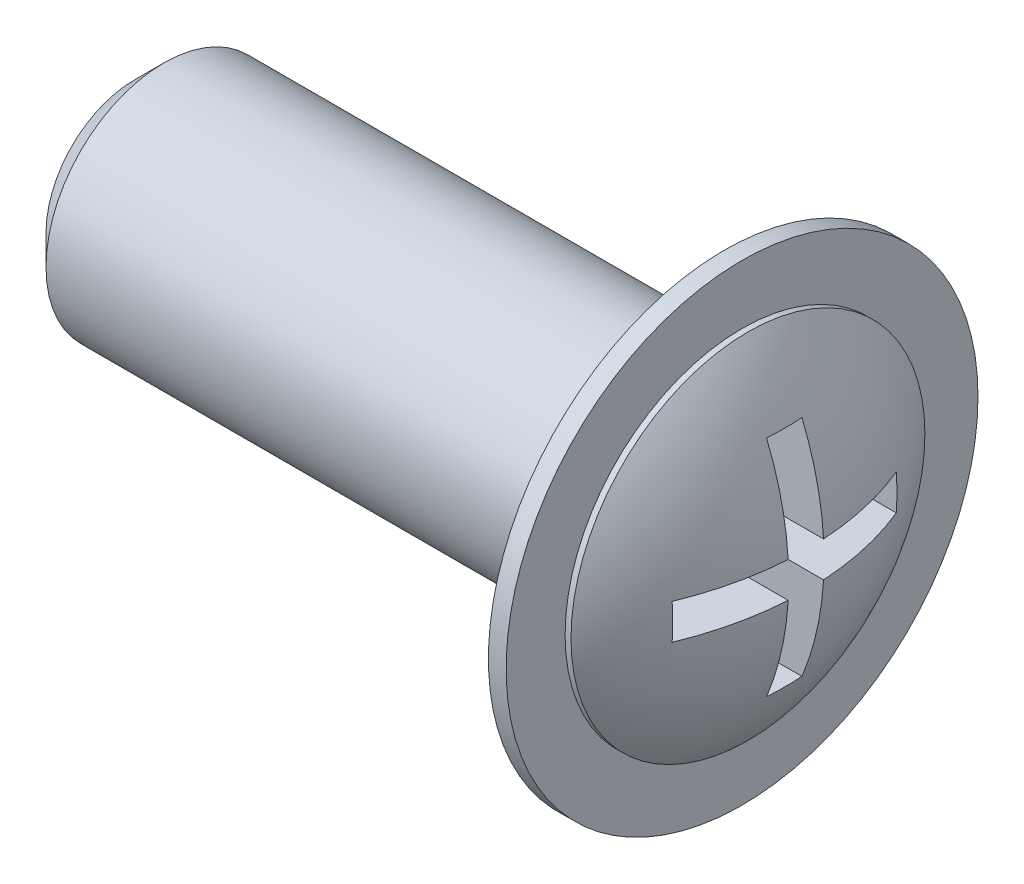
ISO-10303-21;
HEADER;
FILE_DESCRIPTION(('STEP AP214'),'2;1');
FILE_NAME('part.step','',(''),(''),'','','');
FILE_SCHEMA(('AUTOMOTIVE_DESIGN { 1 0 10303 214 1 1 1 1 }'));
ENDSEC;
DATA;
#1=APPLICATION_CONTEXT('core data for automotive mechanical design processes');
#2=APPLICATION_PROTOCOL_DEFINITION('international standard','automotive_design',2000,#1);
#3=PRODUCT_CONTEXT('',#1,'mechanical');
#4=PRODUCT('Part','Part','',(#3));
#5=PRODUCT_RELATED_PRODUCT_CATEGORY('part','',(#4));
#6=PRODUCT_DEFINITION_FORMATION('','',#4);
#7=PRODUCT_DEFINITION_CONTEXT('part definition',#1,'design');
#8=PRODUCT_DEFINITION('design','',#6,#7);
#9=PRODUCT_DEFINITION_SHAPE('','',#8);
#10=(LENGTH_UNIT() NAMED_UNIT(*) SI_UNIT(.MILLI.,.METRE.));
#11=(NAMED_UNIT(*) PLANE_ANGLE_UNIT() SI_UNIT($,.RADIAN.));
#12=(NAMED_UNIT(*) SI_UNIT($,.STERADIAN.) SOLID_ANGLE_UNIT());
#13=UNCERTAINTY_MEASURE_WITH_UNIT(LENGTH_MEASURE(1.E-05),#10,'distance_accuracy_value','');
#14=(GEOMETRIC_REPRESENTATION_CONTEXT(3) GLOBAL_UNCERTAINTY_ASSIGNED_CONTEXT((#13)) GLOBAL_UNIT_ASSIGNED_CONTEXT((#10,
#11,#12)) REPRESENTATION_CONTEXT('',''));
#15=CARTESIAN_POINT('',(0.,0.,0.));
#16=DIRECTION('',(0.,0.,1.));
#17=DIRECTION('',(1.,0.,0.));
#18=AXIS2_PLACEMENT_3D('',#15,#16,#17);
#19=CARTESIAN_POINT('',(-3.6,0.,0.));
#20=DIRECTION('',(0.,0.,1.));
#21=DIRECTION('',(1.,0.,0.));
#22=AXIS2_PLACEMENT_3D('',#19,#20,#21);
#23=SPHERICAL_SURFACE('',#22,5.);
#24=CARTESIAN_POINT('',(0.4,0.,0.));
#25=DIRECTION('',(1.,0.,0.));
#26=DIRECTION('',(0.,0.,-1.));
#27=AXIS2_PLACEMENT_3D('',#24,#25,#26);
#28=CIRCLE('',#27,3.);
#29=CARTESIAN_POINT('',(0.4,0.,-3.));
#30=VERTEX_POINT('',#29);
#31=EDGE_CURVE('E197',#30,#30,#28,.T.);
#32=ORIENTED_EDGE('',*,*,#31,.T.);
#33=EDGE_LOOP('',(#32));
#34=FACE_BOUND('',#33,.T.);
#35=CARTESIAN_POINT('',(-3.6,1.9,0.));
#36=DIRECTION('',(0.,-1.,0.));
#37=DIRECTION('',(0.,0.,-1.));
#38=AXIS2_PLACEMENT_3D('',#35,#36,#37);
#39=CIRCLE('',#38,4.62493243193887);
#40=CARTESIAN_POINT('',(1.01519230368573,1.9,0.3));
#41=VERTEX_POINT('',#40);
#42=CARTESIAN_POINT('',(1.01519230368573,1.9,-0.3));
#43=VERTEX_POINT('',#42);
#44=EDGE_CURVE('E239',#41,#43,#39,.F.);
#45=ORIENTED_EDGE('',*,*,#44,.T.);
#46=CARTESIAN_POINT('',(-3.6,0.,-0.3));
#47=DIRECTION('',(0.,0.,1.));
#48=DIRECTION('',(0.,-1.,0.));
#49=AXIS2_PLACEMENT_3D('',#46,#47,#48);
#50=CIRCLE('',#49,4.99099188538711);
#51=CARTESIAN_POINT('',(1.38196748283246,0.3,-0.3));
#52=VERTEX_POINT('',#51);
#53=EDGE_CURVE('E60',#43,#52,#50,.F.);
#54=ORIENTED_EDGE('',*,*,#53,.T.);
#55=CARTESIAN_POINT('',(-3.6,0.3,0.));
#56=DIRECTION('',(0.,-1.,0.));
#57=DIRECTION('',(0.,0.,-1.));
#58=AXIS2_PLACEMENT_3D('',#55,#56,#57);
#59=CIRCLE('',#58,4.99099188538711);
#60=CARTESIAN_POINT('',(1.01519230368573,0.3,-1.9));
#61=VERTEX_POINT('',#60);
#62=EDGE_CURVE('E207',#52,#61,#59,.F.);
#63=ORIENTED_EDGE('',*,*,#62,.T.);
#64=CARTESIAN_POINT('',(-3.6,0.,-1.9));
#65=DIRECTION('',(0.,0.,1.));
#66=DIRECTION('',(1.,0.,0.));
#67=AXIS2_PLACEMENT_3D('',#64,#65,#66);
#68=CIRCLE('',#67,4.62493243193887);
#69=CARTESIAN_POINT('',(1.01519230368573,-0.3,-1.9));
#70=VERTEX_POINT('',#69);
#71=EDGE_CURVE('E212',#61,#70,#68,.F.);
#72=ORIENTED_EDGE('',*,*,#71,.T.);
#73=CARTESIAN_POINT('',(-3.6,-0.3,0.));
#74=DIRECTION('',(0.,1.,0.));
#75=DIRECTION('',(0.,0.,1.));
#76=AXIS2_PLACEMENT_3D('',#73,#74,#75);
#77=CIRCLE('',#76,4.99099188538711);
#78=CARTESIAN_POINT('',(1.38196748283246,-0.3,-0.3));
#79=VERTEX_POINT('',#78);
#80=EDGE_CURVE('E215',#70,#79,#77,.F.);
#81=ORIENTED_EDGE('',*,*,#80,.T.);
#82=CARTESIAN_POINT('',(-3.6,0.,-0.3));
#83=DIRECTION('',(0.,0.,1.));
#84=DIRECTION('',(0.,-1.,0.));
#85=AXIS2_PLACEMENT_3D('',#82,#83,#84);
#86=CIRCLE('',#85,4.99099188538711);
#87=CARTESIAN_POINT('',(1.01519230368573,-1.9,-0.3));
#88=VERTEX_POINT('',#87);
#89=EDGE_CURVE('E218',#79,#88,#86,.F.);
#90=ORIENTED_EDGE('',*,*,#89,.T.);
#91=CARTESIAN_POINT('',(-3.6,-1.9,0.));
#92=DIRECTION('',(0.,1.,0.));
#93=DIRECTION('',(0.,0.,1.));
#94=AXIS2_PLACEMENT_3D('',#91,#92,#93);
#95=CIRCLE('',#94,4.62493243193887);
#96=CARTESIAN_POINT('',(1.01519230368573,-1.9,0.3));
#97=VERTEX_POINT('',#96);
#98=EDGE_CURVE('E221',#88,#97,#95,.F.);
#99=ORIENTED_EDGE('',*,*,#98,.T.);
#100=CARTESIAN_POINT('',(-3.6,0.,0.3));
#101=DIRECTION('',(0.,0.,-1.));
#102=DIRECTION('',(0.,1.,0.));
#103=AXIS2_PLACEMENT_3D('',#100,#101,#102);
#104=CIRCLE('',#103,4.99099188538711);
#105=CARTESIAN_POINT('',(1.38196748283246,-0.3,0.3));
#106=VERTEX_POINT('',#105);
#107=EDGE_CURVE('E224',#97,#106,#104,.F.);
#108=ORIENTED_EDGE('',*,*,#107,.T.);
#109=CARTESIAN_POINT('',(-3.6,-0.3,0.));
#110=DIRECTION('',(0.,1.,0.));
#111=DIRECTION('',(0.,0.,1.));
#112=AXIS2_PLACEMENT_3D('',#109,#110,#111);
#113=CIRCLE('',#112,4.99099188538711);
#114=CARTESIAN_POINT('',(1.01519230368573,-0.3,1.9));
#115=VERTEX_POINT('',#114);
#116=EDGE_CURVE('E227',#106,#115,#113,.F.);
#117=ORIENTED_EDGE('',*,*,#116,.T.);
#118=CARTESIAN_POINT('',(-3.6,0.,1.9));
#119=DIRECTION('',(0.,0.,-1.));
#120=DIRECTION('',(-1.,0.,0.));
#121=AXIS2_PLACEMENT_3D('',#118,#119,#120);
#122=CIRCLE('',#121,4.62493243193887);
#123=CARTESIAN_POINT('',(1.01519230368573,0.3,1.9));
#124=VERTEX_POINT('',#123);
#125=EDGE_CURVE('E230',#115,#124,#122,.F.);
#126=ORIENTED_EDGE('',*,*,#125,.T.);
#127=CARTESIAN_POINT('',(-3.6,0.3,0.));
#128=DIRECTION('',(0.,-1.,0.));
#129=DIRECTION('',(0.,0.,-1.));
#130=AXIS2_PLACEMENT_3D('',#127,#128,#129);
#131=CIRCLE('',#130,4.99099188538711);
#132=CARTESIAN_POINT('',(1.38196748283246,0.3,0.3));
#133=VERTEX_POINT('',#132);
#134=EDGE_CURVE('E233',#124,#133,#131,.F.);
#135=ORIENTED_EDGE('',*,*,#134,.T.);
#136=CARTESIAN_POINT('',(-3.6,0.,0.3));
#137=DIRECTION('',(0.,0.,-1.));
#138=DIRECTION('',(0.,1.,0.));
#139=AXIS2_PLACEMENT_3D('',#136,#137,#138);
#140=CIRCLE('',#139,4.99099188538711);
#141=EDGE_CURVE('E236',#133,#41,#140,.F.);
#142=ORIENTED_EDGE('',*,*,#141,.T.);
#143=EDGE_LOOP('',(#45,#54,#63,#72,#81,#90,#99,#108,#117,#126,#135,#142));
#144=FACE_BOUND('',#143,.T.);
#145=ADVANCED_FACE('F37',(#34,#144),#23,.T.);
#146=CARTESIAN_POINT('',(0.3,0.,0.));
#147=DIRECTION('',(-1.,0.,0.));
#148=DIRECTION('',(0.,0.,1.));
#149=AXIS2_PLACEMENT_3D('',#146,#147,#148);
#150=CYLINDRICAL_SURFACE('',#149,4.);
#151=CARTESIAN_POINT('',(0.3,0.,0.));
#152=DIRECTION('',(1.,0.,0.));
#153=DIRECTION('',(0.,0.,-1.));
#154=AXIS2_PLACEMENT_3D('',#151,#152,#153);
#155=CIRCLE('',#154,4.);
#156=CARTESIAN_POINT('',(0.3,0.,-4.));
#157=VERTEX_POINT('',#156);
#158=EDGE_CURVE('E198',#157,#157,#155,.T.);
#159=ORIENTED_EDGE('',*,*,#158,.F.);
#160=EDGE_LOOP('',(#159));
#161=FACE_BOUND('',#160,.T.);
#162=CARTESIAN_POINT('',(0.,0.,0.));
#163=DIRECTION('',(1.,0.,0.));
#164=DIRECTION('',(0.,0.,-1.));
#165=AXIS2_PLACEMENT_3D('',#162,#163,#164);
#166=CIRCLE('',#165,4.);
#167=CARTESIAN_POINT('',(0.,0.,-4.));
#168=VERTEX_POINT('',#167);
#169=EDGE_CURVE('E202',#168,#168,#166,.T.);
#170=ORIENTED_EDGE('',*,*,#169,.T.);
#171=EDGE_LOOP('',(#170));
#172=FACE_BOUND('',#171,.T.);
#173=ADVANCED_FACE('F255',(#161,#172),#150,.T.);
#174=CARTESIAN_POINT('',(0.3,0.,0.));
#175=DIRECTION('',(1.,0.,0.));
#176=DIRECTION('',(0.,0.,-1.));
#177=AXIS2_PLACEMENT_3D('',#174,#175,#176);
#178=PLANE('',#177);
#179=CARTESIAN_POINT('',(0.3,0.,0.));
#180=DIRECTION('',(1.,0.,0.));
#181=DIRECTION('',(0.,0.,-1.));
#182=AXIS2_PLACEMENT_3D('',#179,#180,#181);
#183=CIRCLE('',#182,3.);
#184=CARTESIAN_POINT('',(0.3,0.,-3.));
#185=VERTEX_POINT('',#184);
#186=EDGE_CURVE('E132',#185,#185,#183,.T.);
#187=ORIENTED_EDGE('',*,*,#186,.F.);
#188=EDGE_LOOP('',(#187));
#189=FACE_BOUND('',#188,.T.);
#190=ORIENTED_EDGE('',*,*,#158,.T.);
#191=EDGE_LOOP('',(#190));
#192=FACE_BOUND('',#191,.T.);
#193=ADVANCED_FACE('F260',(#189,#192),#178,.T.);
#194=CARTESIAN_POINT('',(0.,0.,0.));
#195=DIRECTION('',(1.,0.,0.));
#196=DIRECTION('',(0.,0.,-1.));
#197=AXIS2_PLACEMENT_3D('',#194,#195,#196);
#198=PLANE('',#197);
#199=CARTESIAN_POINT('',(0.,0.,0.));
#200=DIRECTION('',(1.,0.,0.));
#201=DIRECTION('',(0.,0.,-1.));
#202=AXIS2_PLACEMENT_3D('',#199,#200,#201);
#203=CIRCLE('',#202,2.);
#204=CARTESIAN_POINT('',(0.,0.,-2.));
#205=VERTEX_POINT('',#204);
#206=EDGE_CURVE('E201',#205,#205,#203,.F.);
#207=ORIENTED_EDGE('',*,*,#206,.F.);
#208=EDGE_LOOP('',(#207));
#209=FACE_BOUND('',#208,.T.);
#210=ORIENTED_EDGE('',*,*,#169,.F.);
#211=EDGE_LOOP('',(#210));
#212=FACE_BOUND('',#211,.T.);
#213=ADVANCED_FACE('F265',(#209,#212),#198,.F.);
#214=CARTESIAN_POINT('',(-10.,0.,0.));
#215=DIRECTION('',(1.,0.,0.));
#216=DIRECTION('',(0.,0.,-1.));
#217=AXIS2_PLACEMENT_3D('',#214,#215,#216);
#218=CYLINDRICAL_SURFACE('',#217,2.);
#219=CARTESIAN_POINT('',(-9.5,0.,0.));
#220=DIRECTION('',(-1.,0.,0.));
#221=DIRECTION('',(0.,0.,1.));
#222=AXIS2_PLACEMENT_3D('',#219,#220,#221);
#223=CIRCLE('',#222,2.);
#224=CARTESIAN_POINT('',(-9.5,0.,2.));
#225=VERTEX_POINT('',#224);
#226=EDGE_CURVE('E11',#225,#225,#223,.F.);
#227=ORIENTED_EDGE('',*,*,#226,.T.);
#228=EDGE_LOOP('',(#227));
#229=FACE_BOUND('',#228,.T.);
#230=ORIENTED_EDGE('',*,*,#206,.T.);
#231=EDGE_LOOP('',(#230));
#232=FACE_BOUND('',#231,.T.);
#233=ADVANCED_FACE('F268',(#229,#232),#218,.T.);
#234=CARTESIAN_POINT('',(-10.,0.,0.));
#235=DIRECTION('',(-1.,0.,0.));
#236=DIRECTION('',(0.,0.,1.));
#237=AXIS2_PLACEMENT_3D('',#234,#235,#236);
#238=PLANE('',#237);
#239=CARTESIAN_POINT('',(-10.,0.,0.));
#240=DIRECTION('',(-1.,0.,0.));
#241=DIRECTION('',(0.,0.,1.));
#242=AXIS2_PLACEMENT_3D('',#239,#240,#241);
#243=CIRCLE('',#242,1.5);
#244=CARTESIAN_POINT('',(-10.,0.,1.5));
#245=VERTEX_POINT('',#244);
#246=EDGE_CURVE('E45',#245,#245,#243,.T.);
#247=ORIENTED_EDGE('',*,*,#246,.T.);
#248=EDGE_LOOP('',(#247));
#249=FACE_BOUND('',#248,.T.);
#250=ADVANCED_FACE('F244',(#249),#238,.T.);
#251=CARTESIAN_POINT('',(0.4,0.,0.));
#252=DIRECTION('',(-1.,0.,0.));
#253=DIRECTION('',(0.,0.,1.));
#254=AXIS2_PLACEMENT_3D('',#251,#252,#253);
#255=CYLINDRICAL_SURFACE('',#254,3.);
#256=ORIENTED_EDGE('',*,*,#31,.F.);
#257=EDGE_LOOP('',(#256));
#258=FACE_BOUND('',#257,.T.);
#259=ORIENTED_EDGE('',*,*,#186,.T.);
#260=EDGE_LOOP('',(#259));
#261=FACE_BOUND('',#260,.T.);
#262=ADVANCED_FACE('F278',(#258,#261),#255,.T.);
#263=CARTESIAN_POINT('',(3.,1.9,-0.3));
#264=DIRECTION('',(0.,0.,1.));
#265=DIRECTION('',(0.,-1.,0.));
#266=AXIS2_PLACEMENT_3D('',#263,#264,#265);
#267=PLANE('',#266);
#268=DIRECTION('',(-1.,0.,0.));
#269=VECTOR('',#268,1.);
#270=CARTESIAN_POINT('',(3.,1.9,-0.3));
#271=LINE('',#270,#269);
#272=CARTESIAN_POINT('',(0.,1.9,-0.3));
#273=VERTEX_POINT('',#272);
#274=EDGE_CURVE('E125',#43,#273,#271,.T.);
#275=ORIENTED_EDGE('',*,*,#274,.T.);
#276=DIRECTION('',(0.,1.,0.));
#277=VECTOR('',#276,1.);
#278=CARTESIAN_POINT('',(0.,1.9,-0.3));
#279=LINE('',#278,#277);
#280=CARTESIAN_POINT('',(0.,0.3,-0.3));
#281=VERTEX_POINT('',#280);
#282=EDGE_CURVE('E129',#281,#273,#279,.T.);
#283=ORIENTED_EDGE('',*,*,#282,.F.);
#284=DIRECTION('',(-1.,0.,0.));
#285=VECTOR('',#284,1.);
#286=CARTESIAN_POINT('',(3.,0.3,-0.3));
#287=LINE('',#286,#285);
#288=EDGE_CURVE('E175',#52,#281,#287,.T.);
#289=ORIENTED_EDGE('',*,*,#288,.F.);
#290=ORIENTED_EDGE('',*,*,#53,.F.);
#291=EDGE_LOOP('',(#275,#283,#289,#290));
#292=FACE_BOUND('',#291,.T.);
#293=ADVANCED_FACE('F127',(#292),#267,.T.);
#294=CARTESIAN_POINT('',(3.,1.9,0.3));
#295=DIRECTION('',(0.,-1.,0.));
#296=DIRECTION('',(0.,0.,-1.));
#297=AXIS2_PLACEMENT_3D('',#294,#295,#296);
#298=PLANE('',#297);
#299=DIRECTION('',(-1.,0.,0.));
#300=VECTOR('',#299,1.);
#301=CARTESIAN_POINT('',(3.,1.9,0.3));
#302=LINE('',#301,#300);
#303=CARTESIAN_POINT('',(0.,1.9,0.3));
#304=VERTEX_POINT('',#303);
#305=EDGE_CURVE('E133',#41,#304,#302,.T.);
#306=ORIENTED_EDGE('',*,*,#305,.T.);
#307=DIRECTION('',(0.,0.,1.));
#308=VECTOR('',#307,1.);
#309=CARTESIAN_POINT('',(0.,1.9,0.3));
#310=LINE('',#309,#308);
#311=EDGE_CURVE('E136',#273,#304,#310,.T.);
#312=ORIENTED_EDGE('',*,*,#311,.F.);
#313=ORIENTED_EDGE('',*,*,#274,.F.);
#314=ORIENTED_EDGE('',*,*,#44,.F.);
#315=EDGE_LOOP('',(#306,#312,#313,#314));
#316=FACE_BOUND('',#315,.T.);
#317=ADVANCED_FACE('F137',(#316),#298,.T.);
#318=CARTESIAN_POINT('',(3.,0.3,0.3));
#319=DIRECTION('',(0.,0.,-1.));
#320=DIRECTION('',(0.,1.,0.));
#321=AXIS2_PLACEMENT_3D('',#318,#319,#320);
#322=PLANE('',#321);
#323=DIRECTION('',(-1.,0.,0.));
#324=VECTOR('',#323,1.);
#325=CARTESIAN_POINT('',(3.,0.3,0.3));
#326=LINE('',#325,#324);
#327=CARTESIAN_POINT('',(0.,0.3,0.3));
#328=VERTEX_POINT('',#327);
#329=EDGE_CURVE('E192',#133,#328,#326,.T.);
#330=ORIENTED_EDGE('',*,*,#329,.T.);
#331=DIRECTION('',(0.,-1.,0.));
#332=VECTOR('',#331,1.);
#333=CARTESIAN_POINT('',(0.,0.3,0.3));
#334=LINE('',#333,#332);
#335=EDGE_CURVE('E142',#304,#328,#334,.T.);
#336=ORIENTED_EDGE('',*,*,#335,.F.);
#337=ORIENTED_EDGE('',*,*,#305,.F.);
#338=ORIENTED_EDGE('',*,*,#141,.F.);
#339=EDGE_LOOP('',(#330,#336,#337,#338));
#340=FACE_BOUND('',#339,.T.);
#341=ADVANCED_FACE('F286',(#340),#322,.T.);
#342=CARTESIAN_POINT('',(3.,0.3,1.9));
#343=DIRECTION('',(0.,-1.,0.));
#344=DIRECTION('',(0.,0.,-1.));
#345=AXIS2_PLACEMENT_3D('',#342,#343,#344);
#346=PLANE('',#345);
#347=DIRECTION('',(-1.,0.,0.));
#348=VECTOR('',#347,1.);
#349=CARTESIAN_POINT('',(3.,0.3,1.9));
#350=LINE('',#349,#348);
#351=CARTESIAN_POINT('',(0.,0.3,1.9));
#352=VERTEX_POINT('',#351);
#353=EDGE_CURVE('E190',#124,#352,#350,.T.);
#354=ORIENTED_EDGE('',*,*,#353,.T.);
#355=DIRECTION('',(0.,0.,1.));
#356=VECTOR('',#355,1.);
#357=CARTESIAN_POINT('',(0.,0.3,1.9));
#358=LINE('',#357,#356);
#359=EDGE_CURVE('E151',#328,#352,#358,.T.);
#360=ORIENTED_EDGE('',*,*,#359,.F.);
#361=ORIENTED_EDGE('',*,*,#329,.F.);
#362=ORIENTED_EDGE('',*,*,#134,.F.);
#363=EDGE_LOOP('',(#354,#360,#361,#362));
#364=FACE_BOUND('',#363,.T.);
#365=ADVANCED_FACE('F289',(#364),#346,.T.);
#366=CARTESIAN_POINT('',(3.,-0.3,1.9));
#367=DIRECTION('',(0.,0.,-1.));
#368=DIRECTION('',(-1.,0.,0.));
#369=AXIS2_PLACEMENT_3D('',#366,#367,#368);
#370=PLANE('',#369);
#371=DIRECTION('',(-1.,0.,0.));
#372=VECTOR('',#371,1.);
#373=CARTESIAN_POINT('',(3.,-0.3,1.9));
#374=LINE('',#373,#372);
#375=CARTESIAN_POINT('',(0.,-0.3,1.9));
#376=VERTEX_POINT('',#375);
#377=EDGE_CURVE('E188',#115,#376,#374,.T.);
#378=ORIENTED_EDGE('',*,*,#377,.T.);
#379=DIRECTION('',(0.,-1.,0.));
#380=VECTOR('',#379,1.);
#381=CARTESIAN_POINT('',(0.,-0.3,1.9));
#382=LINE('',#381,#380);
#383=EDGE_CURVE('E154',#352,#376,#382,.T.);
#384=ORIENTED_EDGE('',*,*,#383,.F.);
#385=ORIENTED_EDGE('',*,*,#353,.F.);
#386=ORIENTED_EDGE('',*,*,#125,.F.);
#387=EDGE_LOOP('',(#378,#384,#385,#386));
#388=FACE_BOUND('',#387,.T.);
#389=ADVANCED_FACE('F293',(#388),#370,.T.);
#390=CARTESIAN_POINT('',(3.,-0.3,0.3));
#391=DIRECTION('',(0.,1.,0.));
#392=DIRECTION('',(0.,0.,1.));
#393=AXIS2_PLACEMENT_3D('',#390,#391,#392);
#394=PLANE('',#393);
#395=DIRECTION('',(-1.,0.,0.));
#396=VECTOR('',#395,1.);
#397=CARTESIAN_POINT('',(3.,-0.3,0.3));
#398=LINE('',#397,#396);
#399=CARTESIAN_POINT('',(0.,-0.3,0.3));
#400=VERTEX_POINT('',#399);
#401=EDGE_CURVE('E186',#106,#400,#398,.T.);
#402=ORIENTED_EDGE('',*,*,#401,.T.);
#403=DIRECTION('',(0.,0.,-1.));
#404=VECTOR('',#403,1.);
#405=CARTESIAN_POINT('',(0.,-0.3,0.3));
#406=LINE('',#405,#404);
#407=EDGE_CURVE('E157',#376,#400,#406,.T.);
#408=ORIENTED_EDGE('',*,*,#407,.F.);
#409=ORIENTED_EDGE('',*,*,#377,.F.);
#410=ORIENTED_EDGE('',*,*,#116,.F.);
#411=EDGE_LOOP('',(#402,#408,#409,#410));
#412=FACE_BOUND('',#411,.T.);
#413=ADVANCED_FACE('F297',(#412),#394,.T.);
#414=CARTESIAN_POINT('',(3.,-1.9,0.3));
#415=DIRECTION('',(0.,0.,-1.));
#416=DIRECTION('',(0.,1.,0.));
#417=AXIS2_PLACEMENT_3D('',#414,#415,#416);
#418=PLANE('',#417);
#419=DIRECTION('',(-1.,0.,0.));
#420=VECTOR('',#419,1.);
#421=CARTESIAN_POINT('',(3.,-1.9,0.3));
#422=LINE('',#421,#420);
#423=CARTESIAN_POINT('',(0.,-1.9,0.3));
#424=VERTEX_POINT('',#423);
#425=EDGE_CURVE('E184',#97,#424,#422,.T.);
#426=ORIENTED_EDGE('',*,*,#425,.T.);
#427=DIRECTION('',(0.,-1.,0.));
#428=VECTOR('',#427,1.);
#429=CARTESIAN_POINT('',(0.,-1.9,0.3));
#430=LINE('',#429,#428);
#431=EDGE_CURVE('E160',#400,#424,#430,.T.);
#432=ORIENTED_EDGE('',*,*,#431,.F.);
#433=ORIENTED_EDGE('',*,*,#401,.F.);
#434=ORIENTED_EDGE('',*,*,#107,.F.);
#435=EDGE_LOOP('',(#426,#432,#433,#434));
#436=FACE_BOUND('',#435,.T.);
#437=ADVANCED_FACE('F301',(#436),#418,.T.);
#438=CARTESIAN_POINT('',(3.,-1.9,-0.3));
#439=DIRECTION('',(0.,1.,0.));
#440=DIRECTION('',(0.,0.,1.));
#441=AXIS2_PLACEMENT_3D('',#438,#439,#440);
#442=PLANE('',#441);
#443=DIRECTION('',(-1.,0.,0.));
#444=VECTOR('',#443,1.);
#445=CARTESIAN_POINT('',(3.,-1.9,-0.3));
#446=LINE('',#445,#444);
#447=CARTESIAN_POINT('',(0.,-1.9,-0.3));
#448=VERTEX_POINT('',#447);
#449=EDGE_CURVE('E182',#88,#448,#446,.T.);
#450=ORIENTED_EDGE('',*,*,#449,.T.);
#451=DIRECTION('',(0.,0.,-1.));
#452=VECTOR('',#451,1.);
#453=CARTESIAN_POINT('',(0.,-1.9,-0.3));
#454=LINE('',#453,#452);
#455=EDGE_CURVE('E163',#424,#448,#454,.T.);
#456=ORIENTED_EDGE('',*,*,#455,.F.);
#457=ORIENTED_EDGE('',*,*,#425,.F.);
#458=ORIENTED_EDGE('',*,*,#98,.F.);
#459=EDGE_LOOP('',(#450,#456,#457,#458));
#460=FACE_BOUND('',#459,.T.);
#461=ADVANCED_FACE('F305',(#460),#442,.T.);
#462=CARTESIAN_POINT('',(3.,-0.3,-0.3));
#463=DIRECTION('',(0.,0.,1.));
#464=DIRECTION('',(0.,-1.,0.));
#465=AXIS2_PLACEMENT_3D('',#462,#463,#464);
#466=PLANE('',#465);
#467=DIRECTION('',(-1.,0.,0.));
#468=VECTOR('',#467,1.);
#469=CARTESIAN_POINT('',(3.,-0.3,-0.3));
#470=LINE('',#469,#468);
#471=CARTESIAN_POINT('',(0.,-0.3,-0.3));
#472=VERTEX_POINT('',#471);
#473=EDGE_CURVE('E180',#79,#472,#470,.T.);
#474=ORIENTED_EDGE('',*,*,#473,.T.);
#475=DIRECTION('',(0.,1.,0.));
#476=VECTOR('',#475,1.);
#477=CARTESIAN_POINT('',(0.,-0.3,-0.3));
#478=LINE('',#477,#476);
#479=EDGE_CURVE('E166',#448,#472,#478,.T.);
#480=ORIENTED_EDGE('',*,*,#479,.F.);
#481=ORIENTED_EDGE('',*,*,#449,.F.);
#482=ORIENTED_EDGE('',*,*,#89,.F.);
#483=EDGE_LOOP('',(#474,#480,#481,#482));
#484=FACE_BOUND('',#483,.T.);
#485=ADVANCED_FACE('F309',(#484),#466,.T.);
#486=CARTESIAN_POINT('',(3.,-0.3,-1.9));
#487=DIRECTION('',(0.,1.,0.));
#488=DIRECTION('',(0.,0.,1.));
#489=AXIS2_PLACEMENT_3D('',#486,#487,#488);
#490=PLANE('',#489);
#491=DIRECTION('',(-1.,0.,0.));
#492=VECTOR('',#491,1.);
#493=CARTESIAN_POINT('',(3.,-0.3,-1.9));
#494=LINE('',#493,#492);
#495=CARTESIAN_POINT('',(0.,-0.3,-1.9));
#496=VERTEX_POINT('',#495);
#497=EDGE_CURVE('E178',#70,#496,#494,.T.);
#498=ORIENTED_EDGE('',*,*,#497,.T.);
#499=DIRECTION('',(0.,0.,-1.));
#500=VECTOR('',#499,1.);
#501=CARTESIAN_POINT('',(0.,-0.3,-1.9));
#502=LINE('',#501,#500);
#503=EDGE_CURVE('E169',#472,#496,#502,.T.);
#504=ORIENTED_EDGE('',*,*,#503,.F.);
#505=ORIENTED_EDGE('',*,*,#473,.F.);
#506=ORIENTED_EDGE('',*,*,#80,.F.);
#507=EDGE_LOOP('',(#498,#504,#505,#506));
#508=FACE_BOUND('',#507,.T.);
#509=ADVANCED_FACE('F313',(#508),#490,.T.);
#510=CARTESIAN_POINT('',(3.,0.3,-1.9));
#511=DIRECTION('',(0.,0.,1.));
#512=DIRECTION('',(1.,0.,0.));
#513=AXIS2_PLACEMENT_3D('',#510,#511,#512);
#514=PLANE('',#513);
#515=DIRECTION('',(-1.,0.,0.));
#516=VECTOR('',#515,1.);
#517=CARTESIAN_POINT('',(3.,0.3,-1.9));
#518=LINE('',#517,#516);
#519=CARTESIAN_POINT('',(0.,0.3,-1.9));
#520=VERTEX_POINT('',#519);
#521=EDGE_CURVE('E52',#61,#520,#518,.T.);
#522=ORIENTED_EDGE('',*,*,#521,.T.);
#523=DIRECTION('',(0.,1.,0.));
#524=VECTOR('',#523,1.);
#525=CARTESIAN_POINT('',(0.,0.3,-1.9));
#526=LINE('',#525,#524);
#527=EDGE_CURVE('E172',#496,#520,#526,.T.);
#528=ORIENTED_EDGE('',*,*,#527,.F.);
#529=ORIENTED_EDGE('',*,*,#497,.F.);
#530=ORIENTED_EDGE('',*,*,#71,.F.);
#531=EDGE_LOOP('',(#522,#528,#529,#530));
#532=FACE_BOUND('',#531,.T.);
#533=ADVANCED_FACE('F317',(#532),#514,.T.);
#534=CARTESIAN_POINT('',(3.,0.3,-0.3));
#535=DIRECTION('',(0.,-1.,0.));
#536=DIRECTION('',(0.,0.,-1.));
#537=AXIS2_PLACEMENT_3D('',#534,#535,#536);
#538=PLANE('',#537);
#539=ORIENTED_EDGE('',*,*,#288,.T.);
#540=DIRECTION('',(0.,0.,1.));
#541=VECTOR('',#540,1.);
#542=CARTESIAN_POINT('',(0.,0.3,-0.3));
#543=LINE('',#542,#541);
#544=EDGE_CURVE('E147',#520,#281,#543,.T.);
#545=ORIENTED_EDGE('',*,*,#544,.F.);
#546=ORIENTED_EDGE('',*,*,#521,.F.);
#547=ORIENTED_EDGE('',*,*,#62,.F.);
#548=EDGE_LOOP('',(#539,#545,#546,#547));
#549=FACE_BOUND('',#548,.T.);
#550=ADVANCED_FACE('F251',(#549),#538,.T.);
#551=CARTESIAN_POINT('',(0.,0.,0.));
#552=DIRECTION('',(1.,0.,0.));
#553=DIRECTION('',(0.,0.,-1.));
#554=AXIS2_PLACEMENT_3D('',#551,#552,#553);
#555=PLANE('',#554);
#556=ORIENTED_EDGE('',*,*,#282,.T.);
#557=ORIENTED_EDGE('',*,*,#311,.T.);
#558=ORIENTED_EDGE('',*,*,#335,.T.);
#559=ORIENTED_EDGE('',*,*,#359,.T.);
#560=ORIENTED_EDGE('',*,*,#383,.T.);
#561=ORIENTED_EDGE('',*,*,#407,.T.);
#562=ORIENTED_EDGE('',*,*,#431,.T.);
#563=ORIENTED_EDGE('',*,*,#455,.T.);
#564=ORIENTED_EDGE('',*,*,#479,.T.);
#565=ORIENTED_EDGE('',*,*,#503,.T.);
#566=ORIENTED_EDGE('',*,*,#527,.T.);
#567=ORIENTED_EDGE('',*,*,#544,.T.);
#568=EDGE_LOOP('',(#556,#557,#558,#559,#560,#561,#562,#563,#564,#565,#566,#567));
#569=FACE_BOUND('',#568,.T.);
#570=ADVANCED_FACE('F145',(#569),#555,.T.);
#571=CARTESIAN_POINT('',(-10.,0.,0.));
#572=DIRECTION('',(1.,0.,0.));
#573=DIRECTION('',(0.,0.,-1.));
#574=AXIS2_PLACEMENT_3D('',#571,#572,#573);
#575=CONICAL_SURFACE('',#574,1.5,0.785398163397447);
#576=ORIENTED_EDGE('',*,*,#226,.F.);
#577=EDGE_LOOP('',(#576));
#578=FACE_BOUND('',#577,.T.);
#579=ORIENTED_EDGE('',*,*,#246,.F.);
#580=EDGE_LOOP('',(#579));
#581=FACE_BOUND('',#580,.T.);
#582=ADVANCED_FACE('F39',(#578,#581),#575,.T.);
#583=CLOSED_SHELL('',(#145,#173,#193,#213,#233,#250,#262,#293,#317,#341,#365,#389,#413,#437,
#461,#485,#509,#533,#550,#570,#582));
#584=MANIFOLD_SOLID_BREP('B2',#583);
#585=ADVANCED_BREP_SHAPE_REPRESENTATION('',(#18,#584),#14);
#586=SHAPE_DEFINITION_REPRESENTATION(#9,#585);
ENDSEC;
END-ISO-10303-21;
